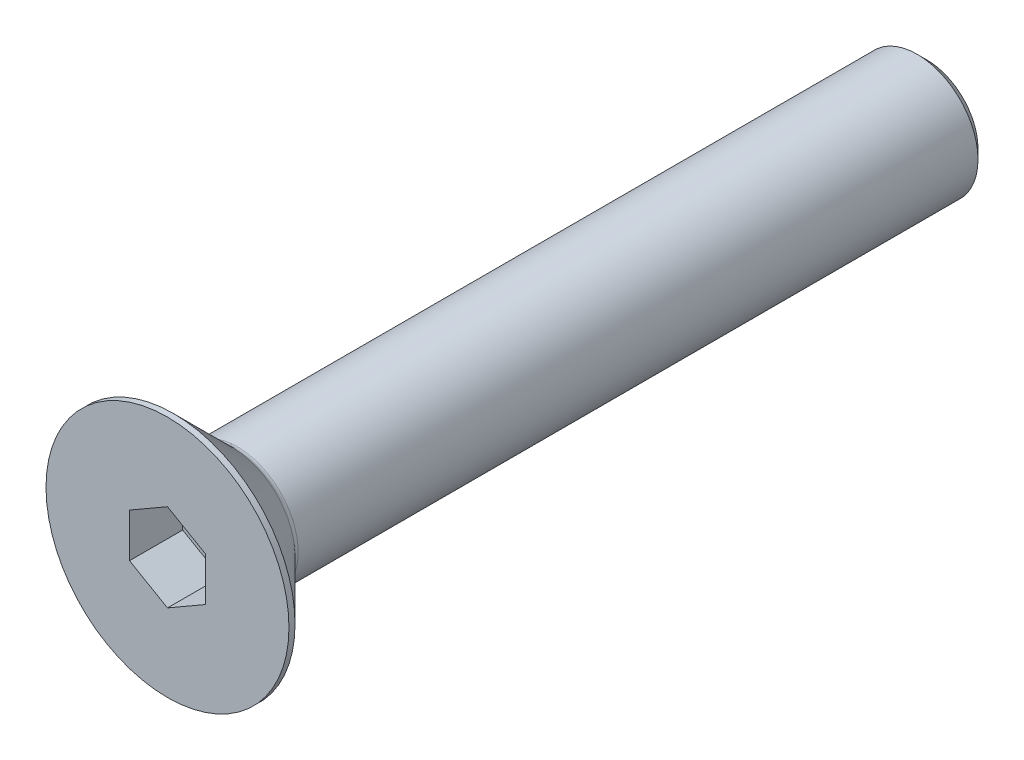
ISO-10303-21;
HEADER;
FILE_DESCRIPTION(('STEP AP214'),'2;1');
FILE_NAME('part.step','',(''),(''),'','','');
FILE_SCHEMA(('AUTOMOTIVE_DESIGN { 1 0 10303 214 1 1 1 1 }'));
ENDSEC;
DATA;
#1=APPLICATION_CONTEXT('core data for automotive mechanical design processes');
#2=APPLICATION_PROTOCOL_DEFINITION('international standard','automotive_design',2000,#1);
#3=PRODUCT_CONTEXT('',#1,'mechanical');
#4=PRODUCT('Part','Part','',(#3));
#5=PRODUCT_RELATED_PRODUCT_CATEGORY('part','',(#4));
#6=PRODUCT_DEFINITION_FORMATION('','',#4);
#7=PRODUCT_DEFINITION_CONTEXT('part definition',#1,'design');
#8=PRODUCT_DEFINITION('design','',#6,#7);
#9=PRODUCT_DEFINITION_SHAPE('','',#8);
#10=(LENGTH_UNIT() NAMED_UNIT(*) SI_UNIT(.MILLI.,.METRE.));
#11=(NAMED_UNIT(*) PLANE_ANGLE_UNIT() SI_UNIT($,.RADIAN.));
#12=(NAMED_UNIT(*) SI_UNIT($,.STERADIAN.) SOLID_ANGLE_UNIT());
#13=UNCERTAINTY_MEASURE_WITH_UNIT(LENGTH_MEASURE(1.E-05),#10,'distance_accuracy_value','');
#14=(GEOMETRIC_REPRESENTATION_CONTEXT(3) GLOBAL_UNCERTAINTY_ASSIGNED_CONTEXT((#13)) GLOBAL_UNIT_ASSIGNED_CONTEXT((#10,
#11,#12)) REPRESENTATION_CONTEXT('',''));
#15=CARTESIAN_POINT('',(0.,0.,0.));
#16=DIRECTION('',(0.,0.,1.));
#17=DIRECTION('',(1.,0.,0.));
#18=AXIS2_PLACEMENT_3D('',#15,#16,#17);
#19=CARTESIAN_POINT('',(0.,0.,-3.5));
#20=DIRECTION('',(0.,0.,1.));
#21=DIRECTION('',(1.,0.,0.));
#22=AXIS2_PLACEMENT_3D('',#19,#20,#21);
#23=PLANE('',#22);
#24=DIRECTION('',(-0.866025403784439,-0.5,0.));
#25=VECTOR('',#24,1.);
#26=CARTESIAN_POINT('',(0.,2.88675134594813,-3.5));
#27=LINE('',#26,#25);
#28=CARTESIAN_POINT('',(0.,2.88675134594813,-3.5));
#29=VERTEX_POINT('',#28);
#30=CARTESIAN_POINT('',(-2.5,1.44337567297406,-3.5));
#31=VERTEX_POINT('',#30);
#32=EDGE_CURVE('E82',#29,#31,#27,.T.);
#33=ORIENTED_EDGE('',*,*,#32,.T.);
#34=DIRECTION('',(0.,1.,0.));
#35=VECTOR('',#34,1.);
#36=CARTESIAN_POINT('',(-2.5,1.44337567297406,-3.5));
#37=LINE('',#36,#35);
#38=CARTESIAN_POINT('',(-2.5,-1.44337567297407,-3.5));
#39=VERTEX_POINT('',#38);
#40=EDGE_CURVE('E66',#31,#39,#37,.F.);
#41=ORIENTED_EDGE('',*,*,#40,.T.);
#42=DIRECTION('',(0.866025403784439,-0.499999999999999,0.));
#43=VECTOR('',#42,1.);
#44=CARTESIAN_POINT('',(-2.5,-1.44337567297407,-3.5));
#45=LINE('',#44,#43);
#46=CARTESIAN_POINT('',(0.,-2.88675134594813,-3.5));
#47=VERTEX_POINT('',#46);
#48=EDGE_CURVE('E71',#39,#47,#45,.T.);
#49=ORIENTED_EDGE('',*,*,#48,.T.);
#50=DIRECTION('',(0.866025403784439,0.5,0.));
#51=VECTOR('',#50,1.);
#52=CARTESIAN_POINT('',(0.,-2.88675134594813,-3.5));
#53=LINE('',#52,#51);
#54=CARTESIAN_POINT('',(2.5,-1.44337567297406,-3.5));
#55=VERTEX_POINT('',#54);
#56=EDGE_CURVE('E128',#47,#55,#53,.T.);
#57=ORIENTED_EDGE('',*,*,#56,.T.);
#58=DIRECTION('',(0.,1.,0.));
#59=VECTOR('',#58,1.);
#60=CARTESIAN_POINT('',(2.5,-1.44337567297406,-3.5));
#61=LINE('',#60,#59);
#62=CARTESIAN_POINT('',(2.5,1.44337567297407,-3.5));
#63=VERTEX_POINT('',#62);
#64=EDGE_CURVE('E132',#55,#63,#61,.T.);
#65=ORIENTED_EDGE('',*,*,#64,.T.);
#66=DIRECTION('',(-0.866025403784439,0.499999999999999,0.));
#67=VECTOR('',#66,1.);
#68=CARTESIAN_POINT('',(2.5,1.44337567297407,-3.5));
#69=LINE('',#68,#67);
#70=EDGE_CURVE('E137',#63,#29,#69,.T.);
#71=ORIENTED_EDGE('',*,*,#70,.T.);
#72=EDGE_LOOP('',(#33,#41,#49,#57,#65,#71));
#73=FACE_BOUND('',#72,.T.);
#74=ADVANCED_FACE('F15',(#73),#23,.T.);
#75=CARTESIAN_POINT('',(-2.5,-1.44337567297407,0.));
#76=DIRECTION('',(-0.499999999999999,-0.866025403784439,0.));
#77=DIRECTION('',(0.866025403784439,-0.499999999999999,0.));
#78=AXIS2_PLACEMENT_3D('',#75,#76,#77);
#79=PLANE('',#78);
#80=DIRECTION('',(0.,0.,1.));
#81=VECTOR('',#80,1.);
#82=CARTESIAN_POINT('',(-2.5,-1.44337567297407,0.));
#83=LINE('',#82,#81);
#84=CARTESIAN_POINT('',(-2.5,-1.44337567297407,0.));
#85=VERTEX_POINT('',#84);
#86=EDGE_CURVE('E73',#39,#85,#83,.T.);
#87=ORIENTED_EDGE('',*,*,#86,.T.);
#88=DIRECTION('',(-0.866025403784439,0.499999999999999,0.));
#89=VECTOR('',#88,1.);
#90=CARTESIAN_POINT('',(0.,-2.88675134594813,0.));
#91=LINE('',#90,#89);
#92=CARTESIAN_POINT('',(0.,-2.88675134594813,0.));
#93=VERTEX_POINT('',#92);
#94=EDGE_CURVE('E126',#93,#85,#91,.T.);
#95=ORIENTED_EDGE('',*,*,#94,.F.);
#96=DIRECTION('',(0.,0.,1.));
#97=VECTOR('',#96,1.);
#98=CARTESIAN_POINT('',(0.,-2.88675134594813,0.));
#99=LINE('',#98,#97);
#100=EDGE_CURVE('E76',#93,#47,#99,.F.);
#101=ORIENTED_EDGE('',*,*,#100,.T.);
#102=ORIENTED_EDGE('',*,*,#48,.F.);
#103=EDGE_LOOP('',(#87,#95,#101,#102));
#104=FACE_BOUND('',#103,.T.);
#105=ADVANCED_FACE('F72',(#104),#79,.F.);
#106=CARTESIAN_POINT('',(-2.5,1.44337567297406,0.));
#107=DIRECTION('',(-1.,0.,0.));
#108=DIRECTION('',(0.,0.,1.));
#109=AXIS2_PLACEMENT_3D('',#106,#107,#108);
#110=PLANE('',#109);
#111=DIRECTION('',(0.,0.,1.));
#112=VECTOR('',#111,1.);
#113=CARTESIAN_POINT('',(-2.5,1.44337567297406,0.));
#114=LINE('',#113,#112);
#115=CARTESIAN_POINT('',(-2.5,1.44337567297406,0.));
#116=VERTEX_POINT('',#115);
#117=EDGE_CURVE('E84',#31,#116,#114,.T.);
#118=ORIENTED_EDGE('',*,*,#117,.T.);
#119=DIRECTION('',(0.,1.,0.));
#120=VECTOR('',#119,1.);
#121=CARTESIAN_POINT('',(-2.5,0.,0.));
#122=LINE('',#121,#120);
#123=EDGE_CURVE('E88',#85,#116,#122,.T.);
#124=ORIENTED_EDGE('',*,*,#123,.F.);
#125=ORIENTED_EDGE('',*,*,#86,.F.);
#126=ORIENTED_EDGE('',*,*,#40,.F.);
#127=EDGE_LOOP('',(#118,#124,#125,#126));
#128=FACE_BOUND('',#127,.T.);
#129=ADVANCED_FACE('F86',(#128),#110,.F.);
#130=CARTESIAN_POINT('',(0.,2.88675134594813,0.));
#131=DIRECTION('',(-0.5,0.866025403784439,0.));
#132=DIRECTION('',(-0.866025403784439,-0.5,0.));
#133=AXIS2_PLACEMENT_3D('',#130,#131,#132);
#134=PLANE('',#133);
#135=DIRECTION('',(0.,0.,1.));
#136=VECTOR('',#135,1.);
#137=CARTESIAN_POINT('',(0.,2.88675134594813,0.));
#138=LINE('',#137,#136);
#139=CARTESIAN_POINT('',(0.,2.88675134594813,0.));
#140=VERTEX_POINT('',#139);
#141=EDGE_CURVE('E139',#29,#140,#138,.T.);
#142=ORIENTED_EDGE('',*,*,#141,.T.);
#143=DIRECTION('',(0.866025403784439,0.499999999999999,0.));
#144=VECTOR('',#143,1.);
#145=CARTESIAN_POINT('',(-2.5,1.44337567297406,0.));
#146=LINE('',#145,#144);
#147=EDGE_CURVE('E122',#116,#140,#146,.T.);
#148=ORIENTED_EDGE('',*,*,#147,.F.);
#149=ORIENTED_EDGE('',*,*,#117,.F.);
#150=ORIENTED_EDGE('',*,*,#32,.F.);
#151=EDGE_LOOP('',(#142,#148,#149,#150));
#152=FACE_BOUND('',#151,.T.);
#153=ADVANCED_FACE('F143',(#152),#134,.F.);
#154=CARTESIAN_POINT('',(2.5,1.44337567297407,0.));
#155=DIRECTION('',(0.499999999999999,0.866025403784439,0.));
#156=DIRECTION('',(-0.866025403784439,0.499999999999999,0.));
#157=AXIS2_PLACEMENT_3D('',#154,#155,#156);
#158=PLANE('',#157);
#159=DIRECTION('',(0.,0.,-1.));
#160=VECTOR('',#159,1.);
#161=CARTESIAN_POINT('',(2.5,1.44337567297407,0.));
#162=LINE('',#161,#160);
#163=CARTESIAN_POINT('',(2.5,1.44337567297407,0.));
#164=VERTEX_POINT('',#163);
#165=EDGE_CURVE('E135',#63,#164,#162,.F.);
#166=ORIENTED_EDGE('',*,*,#165,.T.);
#167=DIRECTION('',(0.866025403784439,-0.499999999999999,0.));
#168=VECTOR('',#167,1.);
#169=CARTESIAN_POINT('',(0.,2.88675134594813,0.));
#170=LINE('',#169,#168);
#171=EDGE_CURVE('E119',#140,#164,#170,.T.);
#172=ORIENTED_EDGE('',*,*,#171,.F.);
#173=ORIENTED_EDGE('',*,*,#141,.F.);
#174=ORIENTED_EDGE('',*,*,#70,.F.);
#175=EDGE_LOOP('',(#166,#172,#173,#174));
#176=FACE_BOUND('',#175,.T.);
#177=ADVANCED_FACE('F154',(#176),#158,.F.);
#178=CARTESIAN_POINT('',(2.5,-1.44337567297406,0.));
#179=DIRECTION('',(1.,0.,0.));
#180=DIRECTION('',(0.,0.,-1.));
#181=AXIS2_PLACEMENT_3D('',#178,#179,#180);
#182=PLANE('',#181);
#183=DIRECTION('',(0.,0.,1.));
#184=VECTOR('',#183,1.);
#185=CARTESIAN_POINT('',(2.5,-1.44337567297406,0.));
#186=LINE('',#185,#184);
#187=CARTESIAN_POINT('',(2.5,-1.44337567297406,0.));
#188=VERTEX_POINT('',#187);
#189=EDGE_CURVE('E34',#55,#188,#186,.T.);
#190=ORIENTED_EDGE('',*,*,#189,.T.);
#191=DIRECTION('',(0.,1.,0.));
#192=VECTOR('',#191,1.);
#193=CARTESIAN_POINT('',(2.5,0.,0.));
#194=LINE('',#193,#192);
#195=EDGE_CURVE('E116',#164,#188,#194,.F.);
#196=ORIENTED_EDGE('',*,*,#195,.F.);
#197=ORIENTED_EDGE('',*,*,#165,.F.);
#198=ORIENTED_EDGE('',*,*,#64,.F.);
#199=EDGE_LOOP('',(#190,#196,#197,#198));
#200=FACE_BOUND('',#199,.T.);
#201=ADVANCED_FACE('F152',(#200),#182,.F.);
#202=CARTESIAN_POINT('',(0.,-2.88675134594813,0.));
#203=DIRECTION('',(0.5,-0.866025403784439,0.));
#204=DIRECTION('',(0.866025403784439,0.5,0.));
#205=AXIS2_PLACEMENT_3D('',#202,#203,#204);
#206=PLANE('',#205);
#207=ORIENTED_EDGE('',*,*,#100,.F.);
#208=DIRECTION('',(-0.866025403784439,-0.499999999999999,0.));
#209=VECTOR('',#208,1.);
#210=CARTESIAN_POINT('',(2.5,-1.44337567297406,0.));
#211=LINE('',#210,#209);
#212=EDGE_CURVE('E113',#188,#93,#211,.T.);
#213=ORIENTED_EDGE('',*,*,#212,.F.);
#214=ORIENTED_EDGE('',*,*,#189,.F.);
#215=ORIENTED_EDGE('',*,*,#56,.F.);
#216=EDGE_LOOP('',(#207,#213,#214,#215));
#217=FACE_BOUND('',#216,.T.);
#218=ADVANCED_FACE('F150',(#217),#206,.F.);
#219=CARTESIAN_POINT('',(4.,0.,0.));
#220=DIRECTION('',(0.,0.,1.));
#221=DIRECTION('',(1.,0.,0.));
#222=AXIS2_PLACEMENT_3D('',#219,#220,#221);
#223=PLANE('',#222);
#224=ORIENTED_EDGE('',*,*,#195,.T.);
#225=ORIENTED_EDGE('',*,*,#212,.T.);
#226=ORIENTED_EDGE('',*,*,#94,.T.);
#227=ORIENTED_EDGE('',*,*,#123,.T.);
#228=ORIENTED_EDGE('',*,*,#147,.T.);
#229=ORIENTED_EDGE('',*,*,#171,.T.);
#230=EDGE_LOOP('',(#224,#225,#226,#227,#228,#229));
#231=FACE_BOUND('',#230,.T.);
#232=CARTESIAN_POINT('',(0.,0.,0.));
#233=DIRECTION('',(0.,0.,-1.));
#234=DIRECTION('',(-1.,0.,0.));
#235=AXIS2_PLACEMENT_3D('',#232,#233,#234);
#236=CIRCLE('',#235,8.);
#237=CARTESIAN_POINT('',(-8.,0.,0.));
#238=VERTEX_POINT('',#237);
#239=EDGE_CURVE('E19',#238,#238,#236,.T.);
#240=ORIENTED_EDGE('',*,*,#239,.F.);
#241=EDGE_LOOP('',(#240));
#242=FACE_BOUND('',#241,.T.);
#243=ADVANCED_FACE('F147',(#231,#242),#223,.T.);
#244=CARTESIAN_POINT('',(0.,0.,-0.200000000000005));
#245=DIRECTION('',(0.,0.,-1.));
#246=DIRECTION('',(-1.,0.,0.));
#247=AXIS2_PLACEMENT_3D('',#244,#245,#246);
#248=CYLINDRICAL_SURFACE('',#247,8.);
#249=ORIENTED_EDGE('',*,*,#239,.T.);
#250=EDGE_LOOP('',(#249));
#251=FACE_BOUND('',#250,.T.);
#252=CARTESIAN_POINT('',(0.,0.,-0.399999998251133));
#253=DIRECTION('',(0.,0.,1.));
#254=DIRECTION('',(1.,0.,0.));
#255=AXIS2_PLACEMENT_3D('',#252,#253,#254);
#256=CIRCLE('',#255,7.99999999821921);
#257=CARTESIAN_POINT('',(7.99999999821921,0.,-0.399999998251133));
#258=VERTEX_POINT('',#257);
#259=EDGE_CURVE('E100',#258,#258,#256,.F.);
#260=ORIENTED_EDGE('',*,*,#259,.F.);
#261=EDGE_LOOP('',(#260));
#262=FACE_BOUND('',#261,.T.);
#263=ADVANCED_FACE('F183',(#251,#262),#248,.T.);
#264=CARTESIAN_POINT('',(0.,0.,-0.399999998251133));
#265=DIRECTION('',(0.,0.,1.));
#266=DIRECTION('',(1.,0.,0.));
#267=AXIS2_PLACEMENT_3D('',#264,#265,#266);
#268=CONICAL_SURFACE('',#267,7.99999999821921,0.785398162505018);
#269=CARTESIAN_POINT('',(0.,0.,-4.25355339059328));
#270=DIRECTION('',(0.,0.,-1.));
#271=DIRECTION('',(0.,1.,0.));
#272=AXIS2_PLACEMENT_3D('',#269,#270,#271);
#273=CIRCLE('',#272,4.14644660940673);
#274=CARTESIAN_POINT('',(0.,4.14644660940673,-4.25355339059328));
#275=VERTEX_POINT('',#274);
#276=EDGE_CURVE('E94',#275,#275,#273,.T.);
#277=ORIENTED_EDGE('',*,*,#276,.F.);
#278=EDGE_LOOP('',(#277));
#279=FACE_BOUND('',#278,.T.);
#280=ORIENTED_EDGE('',*,*,#259,.T.);
#281=EDGE_LOOP('',(#280));
#282=FACE_BOUND('',#281,.T.);
#283=ADVANCED_FACE('F179',(#279,#282),#268,.T.);
#284=CARTESIAN_POINT('',(2.,0.,-50.));
#285=DIRECTION('',(0.,0.,-1.));
#286=DIRECTION('',(-1.,0.,0.));
#287=AXIS2_PLACEMENT_3D('',#284,#285,#286);
#288=PLANE('',#287);
#289=CARTESIAN_POINT('',(0.,0.,-50.0000000002956));
#290=DIRECTION('',(0.,0.,1.));
#291=DIRECTION('',(1.,0.,0.));
#292=AXIS2_PLACEMENT_3D('',#289,#290,#291);
#293=CIRCLE('',#292,3.37500000023283);
#294=CARTESIAN_POINT('',(3.37500000023283,0.,-50.0000000002956));
#295=VERTEX_POINT('',#294);
#296=EDGE_CURVE('E92',#295,#295,#293,.T.);
#297=ORIENTED_EDGE('',*,*,#296,.F.);
#298=EDGE_LOOP('',(#297));
#299=FACE_BOUND('',#298,.T.);
#300=ADVANCED_FACE('F176',(#299),#288,.T.);
#301=CARTESIAN_POINT('',(0.,0.,-4.60710678118655));
#302=DIRECTION('',(0.,0.,-1.));
#303=DIRECTION('',(-1.,0.,0.));
#304=AXIS2_PLACEMENT_3D('',#301,#302,#303);
#305=TOROIDAL_SURFACE('',#304,4.5,0.5);
#306=CARTESIAN_POINT('',(0.,0.,-4.60710678118655));
#307=DIRECTION('',(0.,0.,-1.));
#308=DIRECTION('',(-1.,0.,0.));
#309=AXIS2_PLACEMENT_3D('',#306,#307,#308);
#310=CIRCLE('',#309,4.);
#311=CARTESIAN_POINT('',(-4.,0.,-4.60710678118655));
#312=VERTEX_POINT('',#311);
#313=EDGE_CURVE('E25',#312,#312,#310,.T.);
#314=ORIENTED_EDGE('',*,*,#313,.F.);
#315=EDGE_LOOP('',(#314));
#316=FACE_BOUND('',#315,.T.);
#317=ORIENTED_EDGE('',*,*,#276,.T.);
#318=EDGE_LOOP('',(#317));
#319=FACE_BOUND('',#318,.T.);
#320=ADVANCED_FACE('F17',(#316,#319),#305,.F.);
#321=CARTESIAN_POINT('',(0.,0.,-49.3749999997135));
#322=DIRECTION('',(0.,0.,1.));
#323=DIRECTION('',(1.,0.,0.));
#324=AXIS2_PLACEMENT_3D('',#321,#322,#323);
#325=CONICAL_SURFACE('',#324,3.99999999967804,0.785398162487954);
#326=ORIENTED_EDGE('',*,*,#296,.T.);
#327=EDGE_LOOP('',(#326));
#328=FACE_BOUND('',#327,.T.);
#329=CARTESIAN_POINT('',(0.,0.,-49.375));
#330=DIRECTION('',(0.,0.,-1.));
#331=DIRECTION('',(-1.,0.,0.));
#332=AXIS2_PLACEMENT_3D('',#329,#330,#331);
#333=CIRCLE('',#332,4.);
#334=CARTESIAN_POINT('',(-4.,0.,-49.375));
#335=VERTEX_POINT('',#334);
#336=EDGE_CURVE('E10',#335,#335,#333,.F.);
#337=ORIENTED_EDGE('',*,*,#336,.F.);
#338=EDGE_LOOP('',(#337));
#339=FACE_BOUND('',#338,.T.);
#340=ADVANCED_FACE('F166',(#328,#339),#325,.T.);
#341=CARTESIAN_POINT('',(0.,0.,-27.2));
#342=DIRECTION('',(0.,0.,-1.));
#343=DIRECTION('',(-1.,0.,0.));
#344=AXIS2_PLACEMENT_3D('',#341,#342,#343);
#345=CYLINDRICAL_SURFACE('',#344,4.);
#346=ORIENTED_EDGE('',*,*,#336,.T.);
#347=EDGE_LOOP('',(#346));
#348=FACE_BOUND('',#347,.T.);
#349=ORIENTED_EDGE('',*,*,#313,.T.);
#350=EDGE_LOOP('',(#349));
#351=FACE_BOUND('',#350,.T.);
#352=ADVANCED_FACE('F164',(#348,#351),#345,.T.);
#353=CLOSED_SHELL('',(#74,#105,#129,#153,#177,#201,#218,#243,#263,#283,#300,#320,#340,#352));
#354=MANIFOLD_SOLID_BREP('B1',#353);
#355=ADVANCED_BREP_SHAPE_REPRESENTATION('',(#18,#354),#14);
#356=SHAPE_DEFINITION_REPRESENTATION(#9,#355);
ENDSEC;
END-ISO-10303-21;
